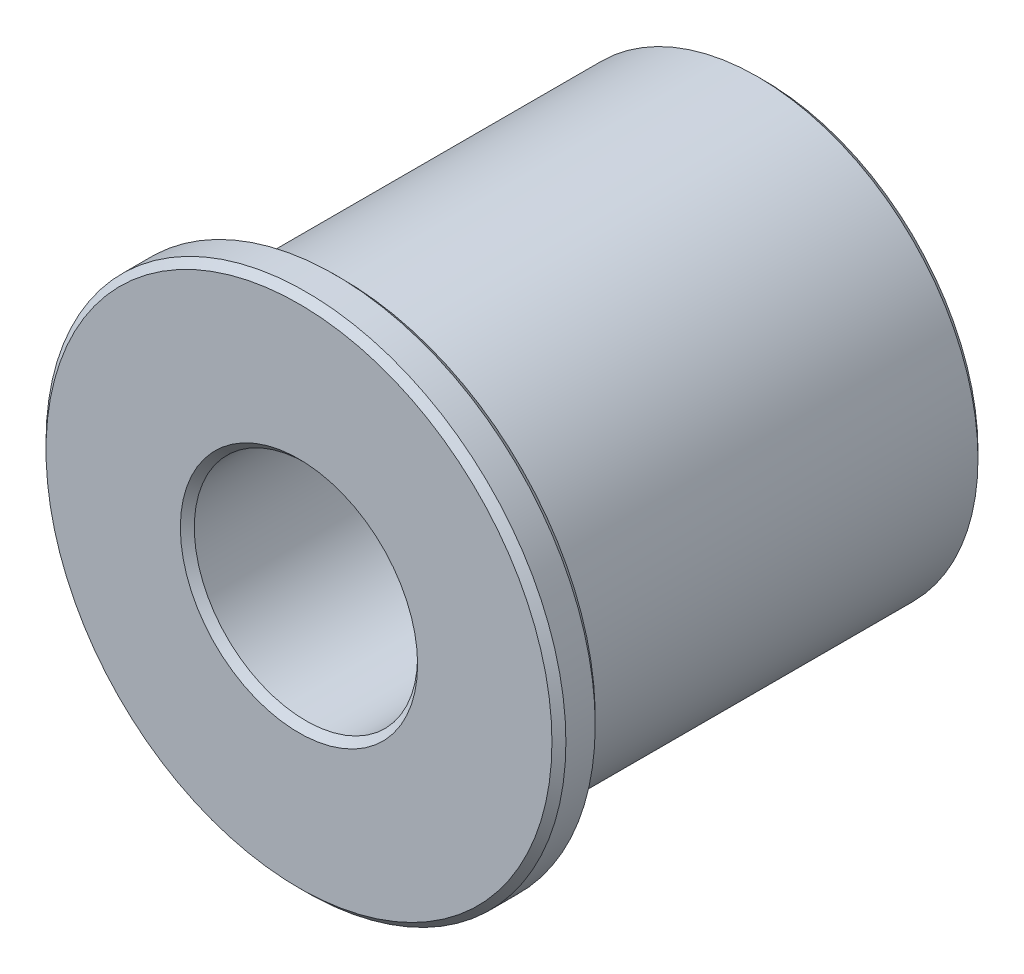
ISO-10303-21;
HEADER;
FILE_DESCRIPTION(('STEP AP214'),'2;1');
FILE_NAME('part.step','',(''),(''),'','','');
FILE_SCHEMA(('AUTOMOTIVE_DESIGN { 1 0 10303 214 1 1 1 1 }'));
ENDSEC;
DATA;
#1=APPLICATION_CONTEXT('core data for automotive mechanical design processes');
#2=APPLICATION_PROTOCOL_DEFINITION('international standard','automotive_design',2000,#1);
#3=PRODUCT_CONTEXT('',#1,'mechanical');
#4=PRODUCT('Part','Part','',(#3));
#5=PRODUCT_RELATED_PRODUCT_CATEGORY('part','',(#4));
#6=PRODUCT_DEFINITION_FORMATION('','',#4);
#7=PRODUCT_DEFINITION_CONTEXT('part definition',#1,'design');
#8=PRODUCT_DEFINITION('design','',#6,#7);
#9=PRODUCT_DEFINITION_SHAPE('','',#8);
#10=(LENGTH_UNIT() NAMED_UNIT(*) SI_UNIT(.MILLI.,.METRE.));
#11=(NAMED_UNIT(*) PLANE_ANGLE_UNIT() SI_UNIT($,.RADIAN.));
#12=(NAMED_UNIT(*) SI_UNIT($,.STERADIAN.) SOLID_ANGLE_UNIT());
#13=UNCERTAINTY_MEASURE_WITH_UNIT(LENGTH_MEASURE(1.E-05),#10,'distance_accuracy_value','');
#14=(GEOMETRIC_REPRESENTATION_CONTEXT(3) GLOBAL_UNCERTAINTY_ASSIGNED_CONTEXT((#13)) GLOBAL_UNIT_ASSIGNED_CONTEXT((#10,
#11,#12)) REPRESENTATION_CONTEXT('',''));
#15=CARTESIAN_POINT('',(0.,0.,0.));
#16=DIRECTION('',(0.,0.,1.));
#17=DIRECTION('',(1.,0.,0.));
#18=AXIS2_PLACEMENT_3D('',#15,#16,#17);
#19=CARTESIAN_POINT('',(0.,0.,0.));
#20=DIRECTION('',(0.,0.,1.));
#21=DIRECTION('',(1.,0.,0.));
#22=AXIS2_PLACEMENT_3D('',#19,#20,#21);
#23=CYLINDRICAL_SURFACE('',#22,2.286);
#24=CARTESIAN_POINT('',(0.,0.,10.346));
#25=DIRECTION('',(0.,0.,1.));
#26=DIRECTION('',(1.,0.,0.));
#27=AXIS2_PLACEMENT_3D('',#24,#25,#26);
#28=CIRCLE('',#27,2.286);
#29=CARTESIAN_POINT('',(2.286,0.,10.346));
#30=VERTEX_POINT('',#29);
#31=EDGE_CURVE('E68',#30,#30,#28,.T.);
#32=ORIENTED_EDGE('',*,*,#31,.T.);
#33=EDGE_LOOP('',(#32));
#34=FACE_BOUND('',#33,.T.);
#35=CARTESIAN_POINT('',(0.,0.,0.254));
#36=DIRECTION('',(0.,0.,-1.));
#37=DIRECTION('',(-1.,0.,0.));
#38=AXIS2_PLACEMENT_3D('',#35,#36,#37);
#39=CIRCLE('',#38,2.286);
#40=CARTESIAN_POINT('',(-2.286,0.,0.254));
#41=VERTEX_POINT('',#40);
#42=EDGE_CURVE('E71',#41,#41,#39,.T.);
#43=ORIENTED_EDGE('',*,*,#42,.T.);
#44=EDGE_LOOP('',(#43));
#45=FACE_BOUND('',#44,.T.);
#46=ADVANCED_FACE('F30',(#34,#45),#23,.F.);
#47=CARTESIAN_POINT('',(2.286,0.,10.6));
#48=DIRECTION('',(0.,0.,1.));
#49=DIRECTION('',(1.,0.,0.));
#50=AXIS2_PLACEMENT_3D('',#47,#48,#49);
#51=PLANE('',#50);
#52=CARTESIAN_POINT('',(0.,0.,10.6));
#53=DIRECTION('',(0.,0.,1.));
#54=DIRECTION('',(1.,0.,0.));
#55=AXIS2_PLACEMENT_3D('',#52,#53,#54);
#56=CIRCLE('',#55,2.54);
#57=CARTESIAN_POINT('',(2.54000000000001,0.,10.6));
#58=VERTEX_POINT('',#57);
#59=EDGE_CURVE('E65',#58,#58,#56,.F.);
#60=ORIENTED_EDGE('',*,*,#59,.T.);
#61=EDGE_LOOP('',(#60));
#62=FACE_BOUND('',#61,.T.);
#63=CARTESIAN_POINT('',(0.,0.,10.6));
#64=DIRECTION('',(0.,0.,1.));
#65=DIRECTION('',(1.,0.,0.));
#66=AXIS2_PLACEMENT_3D('',#63,#64,#65);
#67=CIRCLE('',#66,4.064);
#68=CARTESIAN_POINT('',(4.064,0.,10.6));
#69=VERTEX_POINT('',#68);
#70=EDGE_CURVE('E74',#69,#69,#67,.T.);
#71=ORIENTED_EDGE('',*,*,#70,.T.);
#72=EDGE_LOOP('',(#71));
#73=FACE_BOUND('',#72,.T.);
#74=ADVANCED_FACE('F98',(#62,#73),#51,.T.);
#75=CARTESIAN_POINT('',(0.,0.,0.));
#76=DIRECTION('',(0.,0.,1.));
#77=DIRECTION('',(1.,0.,0.));
#78=AXIS2_PLACEMENT_3D('',#75,#76,#77);
#79=CYLINDRICAL_SURFACE('',#78,4.064);
#80=CARTESIAN_POINT('',(0.,0.,16.6878));
#81=DIRECTION('',(0.,0.,1.));
#82=DIRECTION('',(1.,0.,0.));
#83=AXIS2_PLACEMENT_3D('',#80,#81,#82);
#84=CIRCLE('',#83,4.064);
#85=CARTESIAN_POINT('',(4.064,0.,16.6878));
#86=VERTEX_POINT('',#85);
#87=EDGE_CURVE('E53',#86,#86,#84,.T.);
#88=ORIENTED_EDGE('',*,*,#87,.T.);
#89=EDGE_LOOP('',(#88));
#90=FACE_BOUND('',#89,.T.);
#91=ORIENTED_EDGE('',*,*,#70,.F.);
#92=EDGE_LOOP('',(#91));
#93=FACE_BOUND('',#92,.T.);
#94=ADVANCED_FACE('F104',(#90,#93),#79,.F.);
#95=CARTESIAN_POINT('',(4.064,0.,16.9418));
#96=DIRECTION('',(0.,0.,1.));
#97=DIRECTION('',(1.,0.,0.));
#98=AXIS2_PLACEMENT_3D('',#95,#96,#97);
#99=PLANE('',#98);
#100=CARTESIAN_POINT('',(0.,0.,16.9418));
#101=DIRECTION('',(0.,0.,1.));
#102=DIRECTION('',(1.,0.,0.));
#103=AXIS2_PLACEMENT_3D('',#100,#101,#102);
#104=CIRCLE('',#103,4.31800000000001);
#105=CARTESIAN_POINT('',(4.31800000000001,0.,16.9418));
#106=VERTEX_POINT('',#105);
#107=EDGE_CURVE('E45',#106,#106,#104,.F.);
#108=ORIENTED_EDGE('',*,*,#107,.T.);
#109=EDGE_LOOP('',(#108));
#110=FACE_BOUND('',#109,.T.);
#111=CARTESIAN_POINT('',(0.,0.,16.9418));
#112=DIRECTION('',(0.,0.,1.));
#113=DIRECTION('',(1.,0.,0.));
#114=AXIS2_PLACEMENT_3D('',#111,#112,#113);
#115=CIRCLE('',#114,9.2075);
#116=CARTESIAN_POINT('',(9.2075,0.,16.9418));
#117=VERTEX_POINT('',#116);
#118=EDGE_CURVE('E50',#117,#117,#115,.T.);
#119=ORIENTED_EDGE('',*,*,#118,.T.);
#120=EDGE_LOOP('',(#119));
#121=FACE_BOUND('',#120,.T.);
#122=ADVANCED_FACE('F138',(#110,#121),#99,.T.);
#123=CARTESIAN_POINT('',(0.,0.,0.));
#124=DIRECTION('',(0.,0.,1.));
#125=DIRECTION('',(1.,0.,0.));
#126=AXIS2_PLACEMENT_3D('',#123,#124,#125);
#127=CYLINDRICAL_SURFACE('',#126,9.4615);
#128=CARTESIAN_POINT('',(0.,0.,15.621));
#129=DIRECTION('',(0.,0.,-1.));
#130=DIRECTION('',(-1.,0.,0.));
#131=AXIS2_PLACEMENT_3D('',#128,#129,#130);
#132=CIRCLE('',#131,9.4615);
#133=CARTESIAN_POINT('',(-9.4615,0.,15.621));
#134=VERTEX_POINT('',#133);
#135=EDGE_CURVE('E37',#134,#134,#132,.F.);
#136=ORIENTED_EDGE('',*,*,#135,.T.);
#137=EDGE_LOOP('',(#136));
#138=FACE_BOUND('',#137,.T.);
#139=CARTESIAN_POINT('',(0.,0.,16.6878));
#140=DIRECTION('',(0.,0.,1.));
#141=DIRECTION('',(1.,0.,0.));
#142=AXIS2_PLACEMENT_3D('',#139,#140,#141);
#143=CIRCLE('',#142,9.4615);
#144=CARTESIAN_POINT('',(9.4615,0.,16.6878));
#145=VERTEX_POINT('',#144);
#146=EDGE_CURVE('E41',#145,#145,#143,.F.);
#147=ORIENTED_EDGE('',*,*,#146,.T.);
#148=EDGE_LOOP('',(#147));
#149=FACE_BOUND('',#148,.T.);
#150=ADVANCED_FACE('F95',(#138,#149),#127,.T.);
#151=CARTESIAN_POINT('',(8.0264,0.,15.367));
#152=DIRECTION('',(0.,0.,-1.));
#153=DIRECTION('',(-1.,0.,0.));
#154=AXIS2_PLACEMENT_3D('',#151,#152,#153);
#155=PLANE('',#154);
#156=CARTESIAN_POINT('',(0.,0.,15.367));
#157=DIRECTION('',(0.,0.,-1.));
#158=DIRECTION('',(-1.,0.,0.));
#159=AXIS2_PLACEMENT_3D('',#156,#157,#158);
#160=CIRCLE('',#159,9.2075);
#161=CARTESIAN_POINT('',(-9.2075,0.,15.367));
#162=VERTEX_POINT('',#161);
#163=EDGE_CURVE('E10',#162,#162,#160,.T.);
#164=ORIENTED_EDGE('',*,*,#163,.T.);
#165=EDGE_LOOP('',(#164));
#166=FACE_BOUND('',#165,.T.);
#167=CARTESIAN_POINT('',(0.,0.,15.367));
#168=DIRECTION('',(0.,0.,1.));
#169=DIRECTION('',(1.,0.,0.));
#170=AXIS2_PLACEMENT_3D('',#167,#168,#169);
#171=CIRCLE('',#170,8.0264);
#172=CARTESIAN_POINT('',(8.0264,0.,15.367));
#173=VERTEX_POINT('',#172);
#174=EDGE_CURVE('E77',#173,#173,#171,.T.);
#175=ORIENTED_EDGE('',*,*,#174,.T.);
#176=EDGE_LOOP('',(#175));
#177=FACE_BOUND('',#176,.T.);
#178=ADVANCED_FACE('F81',(#166,#177),#155,.T.);
#179=CARTESIAN_POINT('',(0.,0.,0.));
#180=DIRECTION('',(0.,0.,1.));
#181=DIRECTION('',(1.,0.,0.));
#182=AXIS2_PLACEMENT_3D('',#179,#180,#181);
#183=CYLINDRICAL_SURFACE('',#182,8.0264);
#184=CARTESIAN_POINT('',(0.,0.,0.254000000000003));
#185=DIRECTION('',(0.,0.,-1.));
#186=DIRECTION('',(-1.,0.,0.));
#187=AXIS2_PLACEMENT_3D('',#184,#185,#186);
#188=CIRCLE('',#187,8.0264);
#189=CARTESIAN_POINT('',(-8.0264,0.,0.254000000000004));
#190=VERTEX_POINT('',#189);
#191=EDGE_CURVE('E56',#190,#190,#188,.F.);
#192=ORIENTED_EDGE('',*,*,#191,.T.);
#193=EDGE_LOOP('',(#192));
#194=FACE_BOUND('',#193,.T.);
#195=ORIENTED_EDGE('',*,*,#174,.F.);
#196=EDGE_LOOP('',(#195));
#197=FACE_BOUND('',#196,.T.);
#198=ADVANCED_FACE('F83',(#194,#197),#183,.T.);
#199=CARTESIAN_POINT('',(8.0264,0.,0.));
#200=DIRECTION('',(0.,0.,-1.));
#201=DIRECTION('',(-1.,0.,0.));
#202=AXIS2_PLACEMENT_3D('',#199,#200,#201);
#203=PLANE('',#202);
#204=CARTESIAN_POINT('',(0.,0.,0.));
#205=DIRECTION('',(0.,0.,-1.));
#206=DIRECTION('',(-1.,0.,0.));
#207=AXIS2_PLACEMENT_3D('',#204,#205,#206);
#208=CIRCLE('',#207,2.54);
#209=CARTESIAN_POINT('',(-2.54,0.,0.));
#210=VERTEX_POINT('',#209);
#211=EDGE_CURVE('E59',#210,#210,#208,.F.);
#212=ORIENTED_EDGE('',*,*,#211,.T.);
#213=EDGE_LOOP('',(#212));
#214=FACE_BOUND('',#213,.T.);
#215=CARTESIAN_POINT('',(0.,0.,0.));
#216=DIRECTION('',(0.,0.,-1.));
#217=DIRECTION('',(-1.,0.,0.));
#218=AXIS2_PLACEMENT_3D('',#215,#216,#217);
#219=CIRCLE('',#218,7.77239999999999);
#220=CARTESIAN_POINT('',(-7.77239999999999,0.,0.));
#221=VERTEX_POINT('',#220);
#222=EDGE_CURVE('E62',#221,#221,#219,.T.);
#223=ORIENTED_EDGE('',*,*,#222,.T.);
#224=EDGE_LOOP('',(#223));
#225=FACE_BOUND('',#224,.T.);
#226=ADVANCED_FACE('F85',(#214,#225),#203,.T.);
#227=CARTESIAN_POINT('',(0.,0.,10.346));
#228=DIRECTION('',(0.,0.,1.));
#229=DIRECTION('',(1.,0.,0.));
#230=AXIS2_PLACEMENT_3D('',#227,#228,#229);
#231=CONICAL_SURFACE('',#230,2.286,0.785398163397458);
#232=ORIENTED_EDGE('',*,*,#59,.F.);
#233=EDGE_LOOP('',(#232));
#234=FACE_BOUND('',#233,.T.);
#235=ORIENTED_EDGE('',*,*,#31,.F.);
#236=EDGE_LOOP('',(#235));
#237=FACE_BOUND('',#236,.T.);
#238=ADVANCED_FACE('F92',(#234,#237),#231,.F.);
#239=CARTESIAN_POINT('',(0.,0.,0.));
#240=DIRECTION('',(0.,0.,-1.));
#241=DIRECTION('',(-1.,0.,0.));
#242=AXIS2_PLACEMENT_3D('',#239,#240,#241);
#243=CONICAL_SURFACE('',#242,2.54,0.785398163397443);
#244=ORIENTED_EDGE('',*,*,#42,.F.);
#245=EDGE_LOOP('',(#244));
#246=FACE_BOUND('',#245,.T.);
#247=ORIENTED_EDGE('',*,*,#211,.F.);
#248=EDGE_LOOP('',(#247));
#249=FACE_BOUND('',#248,.T.);
#250=ADVANCED_FACE('F112',(#246,#249),#243,.F.);
#251=CARTESIAN_POINT('',(0.,0.,0.254000000000003));
#252=DIRECTION('',(0.,0.,1.));
#253=DIRECTION('',(1.,0.,0.));
#254=AXIS2_PLACEMENT_3D('',#251,#252,#253);
#255=CONICAL_SURFACE('',#254,8.0264,0.785398163397455);
#256=ORIENTED_EDGE('',*,*,#222,.F.);
#257=EDGE_LOOP('',(#256));
#258=FACE_BOUND('',#257,.T.);
#259=ORIENTED_EDGE('',*,*,#191,.F.);
#260=EDGE_LOOP('',(#259));
#261=FACE_BOUND('',#260,.T.);
#262=ADVANCED_FACE('F116',(#258,#261),#255,.T.);
#263=CARTESIAN_POINT('',(0.,0.,16.6878));
#264=DIRECTION('',(0.,0.,1.));
#265=DIRECTION('',(1.,0.,0.));
#266=AXIS2_PLACEMENT_3D('',#263,#264,#265);
#267=CONICAL_SURFACE('',#266,4.064,0.78539816339745);
#268=ORIENTED_EDGE('',*,*,#107,.F.);
#269=EDGE_LOOP('',(#268));
#270=FACE_BOUND('',#269,.T.);
#271=ORIENTED_EDGE('',*,*,#87,.F.);
#272=EDGE_LOOP('',(#271));
#273=FACE_BOUND('',#272,.T.);
#274=ADVANCED_FACE('F120',(#270,#273),#267,.F.);
#275=CARTESIAN_POINT('',(0.,0.,15.621));
#276=DIRECTION('',(0.,0.,1.));
#277=DIRECTION('',(1.,0.,0.));
#278=AXIS2_PLACEMENT_3D('',#275,#276,#277);
#279=CONICAL_SURFACE('',#278,9.4615,0.785398163397442);
#280=ORIENTED_EDGE('',*,*,#163,.F.);
#281=EDGE_LOOP('',(#280));
#282=FACE_BOUND('',#281,.T.);
#283=ORIENTED_EDGE('',*,*,#135,.F.);
#284=EDGE_LOOP('',(#283));
#285=FACE_BOUND('',#284,.T.);
#286=ADVANCED_FACE('F123',(#282,#285),#279,.T.);
#287=CARTESIAN_POINT('',(0.,0.,16.9418));
#288=DIRECTION('',(0.,0.,-1.));
#289=DIRECTION('',(-1.,0.,0.));
#290=AXIS2_PLACEMENT_3D('',#287,#288,#289);
#291=CONICAL_SURFACE('',#290,9.2075,0.785398163397452);
#292=ORIENTED_EDGE('',*,*,#146,.F.);
#293=EDGE_LOOP('',(#292));
#294=FACE_BOUND('',#293,.T.);
#295=ORIENTED_EDGE('',*,*,#118,.F.);
#296=EDGE_LOOP('',(#295));
#297=FACE_BOUND('',#296,.T.);
#298=ADVANCED_FACE('F32',(#294,#297),#291,.T.);
#299=CLOSED_SHELL('',(#46,#74,#94,#122,#150,#178,#198,#226,#238,#250,#262,#274,#286,#298));
#300=MANIFOLD_SOLID_BREP('B2',#299);
#301=ADVANCED_BREP_SHAPE_REPRESENTATION('',(#18,#300),#14);
#302=SHAPE_DEFINITION_REPRESENTATION(#9,#301);
ENDSEC;
END-ISO-10303-21;
